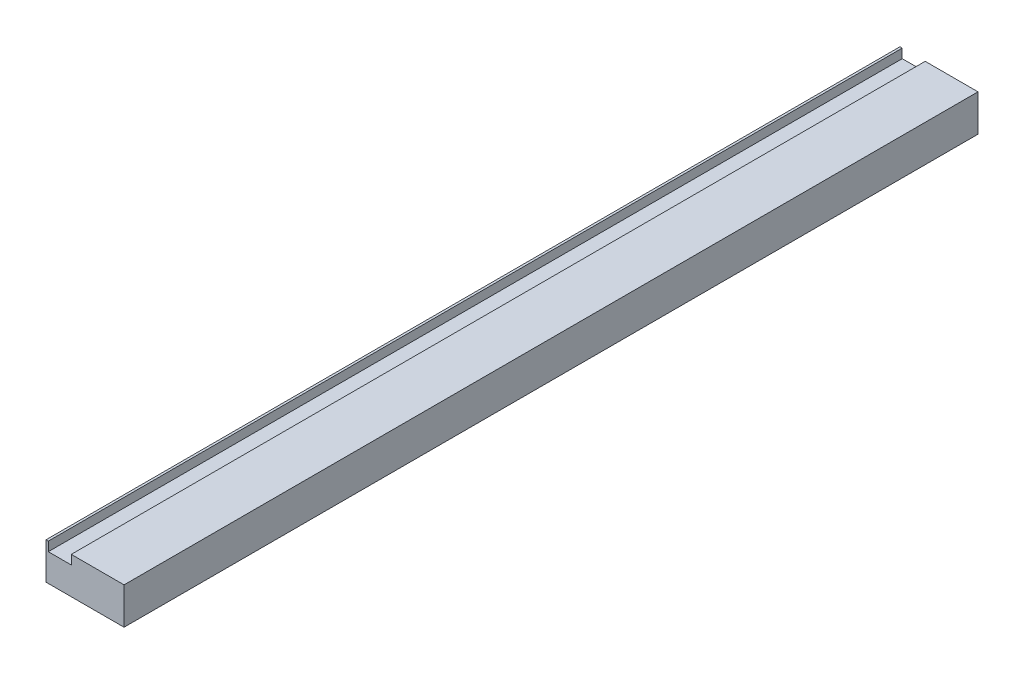
ISO-10303-21;
HEADER;
FILE_DESCRIPTION(('STEP AP214'),'2;1');
FILE_NAME('part.step','',(''),(''),'','','');
FILE_SCHEMA(('AUTOMOTIVE_DESIGN { 1 0 10303 214 1 1 1 1 }'));
ENDSEC;
DATA;
#1=APPLICATION_CONTEXT('core data for automotive mechanical design processes');
#2=APPLICATION_PROTOCOL_DEFINITION('international standard','automotive_design',2000,#1);
#3=PRODUCT_CONTEXT('',#1,'mechanical');
#4=PRODUCT('Part','Part','',(#3));
#5=PRODUCT_RELATED_PRODUCT_CATEGORY('part','',(#4));
#6=PRODUCT_DEFINITION_FORMATION('','',#4);
#7=PRODUCT_DEFINITION_CONTEXT('part definition',#1,'design');
#8=PRODUCT_DEFINITION('design','',#6,#7);
#9=PRODUCT_DEFINITION_SHAPE('','',#8);
#10=(LENGTH_UNIT() NAMED_UNIT(*) SI_UNIT(.MILLI.,.METRE.));
#11=(NAMED_UNIT(*) PLANE_ANGLE_UNIT() SI_UNIT($,.RADIAN.));
#12=(NAMED_UNIT(*) SI_UNIT($,.STERADIAN.) SOLID_ANGLE_UNIT());
#13=UNCERTAINTY_MEASURE_WITH_UNIT(LENGTH_MEASURE(1.E-05),#10,'distance_accuracy_value','');
#14=(GEOMETRIC_REPRESENTATION_CONTEXT(3) GLOBAL_UNCERTAINTY_ASSIGNED_CONTEXT((#13)) GLOBAL_UNIT_ASSIGNED_CONTEXT((#10,
#11,#12)) REPRESENTATION_CONTEXT('',''));
#15=CARTESIAN_POINT('',(0.,0.,0.));
#16=DIRECTION('',(0.,0.,1.));
#17=DIRECTION('',(1.,0.,0.));
#18=AXIS2_PLACEMENT_3D('',#15,#16,#17);
#19=CARTESIAN_POINT('',(0.,20.,0.));
#20=DIRECTION('',(0.,-1.,0.));
#21=DIRECTION('',(0.,0.,-1.));
#22=AXIS2_PLACEMENT_3D('',#19,#20,#21);
#23=PLANE('',#22);
#24=DIRECTION('',(-1.,0.,0.));
#25=VECTOR('',#24,1.);
#26=CARTESIAN_POINT('',(-7.5,20.,-232.5));
#27=LINE('',#26,#25);
#28=CARTESIAN_POINT('',(35.,20.,-232.5));
#29=VERTEX_POINT('',#28);
#30=CARTESIAN_POINT('',(6.25,20.,-232.5));
#31=VERTEX_POINT('',#30);
#32=EDGE_CURVE('E95',#29,#31,#27,.T.);
#33=ORIENTED_EDGE('',*,*,#32,.T.);
#34=DIRECTION('',(0.,0.,-1.));
#35=VECTOR('',#34,1.);
#36=CARTESIAN_POINT('',(6.25,20.,232.5));
#37=LINE('',#36,#35);
#38=CARTESIAN_POINT('',(6.25,20.,232.5));
#39=VERTEX_POINT('',#38);
#40=EDGE_CURVE('E116',#39,#31,#37,.T.);
#41=ORIENTED_EDGE('',*,*,#40,.F.);
#42=DIRECTION('',(1.,0.,0.));
#43=VECTOR('',#42,1.);
#44=CARTESIAN_POINT('',(-7.5,20.,232.5));
#45=LINE('',#44,#43);
#46=CARTESIAN_POINT('',(35.,20.,232.5));
#47=VERTEX_POINT('',#46);
#48=EDGE_CURVE('E101',#39,#47,#45,.T.);
#49=ORIENTED_EDGE('',*,*,#48,.T.);
#50=DIRECTION('',(0.,0.,-1.));
#51=VECTOR('',#50,1.);
#52=CARTESIAN_POINT('',(35.,20.,-232.5));
#53=LINE('',#52,#51);
#54=EDGE_CURVE('E119',#47,#29,#53,.T.);
#55=ORIENTED_EDGE('',*,*,#54,.T.);
#56=EDGE_LOOP('',(#33,#41,#49,#55));
#57=FACE_BOUND('',#56,.T.);
#58=ADVANCED_FACE('F33',(#57),#23,.F.);
#59=CARTESIAN_POINT('',(-7.5,20.,-232.5));
#60=DIRECTION('',(0.,0.,1.));
#61=DIRECTION('',(1.,0.,0.));
#62=AXIS2_PLACEMENT_3D('',#59,#60,#61);
#63=PLANE('',#62);
#64=DIRECTION('',(-1.,0.,0.));
#65=VECTOR('',#64,1.);
#66=CARTESIAN_POINT('',(-6.25,15.,-232.5));
#67=LINE('',#66,#65);
#68=CARTESIAN_POINT('',(6.25,15.,-232.5));
#69=VERTEX_POINT('',#68);
#70=CARTESIAN_POINT('',(-6.25,15.,-232.5));
#71=VERTEX_POINT('',#70);
#72=EDGE_CURVE('E125',#69,#71,#67,.T.);
#73=ORIENTED_EDGE('',*,*,#72,.F.);
#74=DIRECTION('',(0.,1.,0.));
#75=VECTOR('',#74,1.);
#76=CARTESIAN_POINT('',(6.25,15.,-232.5));
#77=LINE('',#76,#75);
#78=EDGE_CURVE('E104',#69,#31,#77,.T.);
#79=ORIENTED_EDGE('',*,*,#78,.T.);
#80=ORIENTED_EDGE('',*,*,#32,.F.);
#81=DIRECTION('',(0.,-1.,0.));
#82=VECTOR('',#81,1.);
#83=CARTESIAN_POINT('',(35.,20.,-232.5));
#84=LINE('',#83,#82);
#85=CARTESIAN_POINT('',(35.,0.,-232.5));
#86=VERTEX_POINT('',#85);
#87=EDGE_CURVE('E135',#29,#86,#84,.T.);
#88=ORIENTED_EDGE('',*,*,#87,.T.);
#89=DIRECTION('',(-1.,0.,0.));
#90=VECTOR('',#89,1.);
#91=CARTESIAN_POINT('',(-7.5,0.,-232.5));
#92=LINE('',#91,#90);
#93=CARTESIAN_POINT('',(-7.5,0.,-232.5));
#94=VERTEX_POINT('',#93);
#95=EDGE_CURVE('E78',#86,#94,#92,.T.);
#96=ORIENTED_EDGE('',*,*,#95,.T.);
#97=DIRECTION('',(0.,-1.,0.));
#98=VECTOR('',#97,1.);
#99=CARTESIAN_POINT('',(-7.5,20.,-232.5));
#100=LINE('',#99,#98);
#101=CARTESIAN_POINT('',(-7.5,20.,-232.5));
#102=VERTEX_POINT('',#101);
#103=EDGE_CURVE('E11',#102,#94,#100,.T.);
#104=ORIENTED_EDGE('',*,*,#103,.F.);
#105=CARTESIAN_POINT('',(-6.25,20.,-232.5));
#106=VERTEX_POINT('',#105);
#107=EDGE_CURVE('E93',#106,#102,#27,.T.);
#108=ORIENTED_EDGE('',*,*,#107,.F.);
#109=DIRECTION('',(0.,1.,0.));
#110=VECTOR('',#109,1.);
#111=CARTESIAN_POINT('',(-6.25,15.,-232.5));
#112=LINE('',#111,#110);
#113=EDGE_CURVE('E48',#71,#106,#112,.T.);
#114=ORIENTED_EDGE('',*,*,#113,.F.);
#115=EDGE_LOOP('',(#73,#79,#80,#88,#96,#104,#108,#114));
#116=FACE_BOUND('',#115,.T.);
#117=ADVANCED_FACE('F35',(#116),#63,.F.);
#118=CARTESIAN_POINT('',(-7.5,20.,232.5));
#119=DIRECTION('',(1.,0.,0.));
#120=DIRECTION('',(0.,0.,-1.));
#121=AXIS2_PLACEMENT_3D('',#118,#119,#120);
#122=PLANE('',#121);
#123=DIRECTION('',(0.,0.,1.));
#124=VECTOR('',#123,1.);
#125=CARTESIAN_POINT('',(-7.5,0.,232.5));
#126=LINE('',#125,#124);
#127=CARTESIAN_POINT('',(-7.5,0.,232.5));
#128=VERTEX_POINT('',#127);
#129=EDGE_CURVE('E69',#94,#128,#126,.T.);
#130=ORIENTED_EDGE('',*,*,#129,.T.);
#131=DIRECTION('',(0.,-1.,0.));
#132=VECTOR('',#131,1.);
#133=CARTESIAN_POINT('',(-7.5,20.,232.5));
#134=LINE('',#133,#132);
#135=CARTESIAN_POINT('',(-7.5,20.,232.5));
#136=VERTEX_POINT('',#135);
#137=EDGE_CURVE('E41',#136,#128,#134,.T.);
#138=ORIENTED_EDGE('',*,*,#137,.F.);
#139=DIRECTION('',(0.,0.,1.));
#140=VECTOR('',#139,1.);
#141=CARTESIAN_POINT('',(-7.5,20.,232.5));
#142=LINE('',#141,#140);
#143=EDGE_CURVE('E57',#102,#136,#142,.T.);
#144=ORIENTED_EDGE('',*,*,#143,.F.);
#145=ORIENTED_EDGE('',*,*,#103,.T.);
#146=EDGE_LOOP('',(#130,#138,#144,#145));
#147=FACE_BOUND('',#146,.T.);
#148=ADVANCED_FACE('F71',(#147),#122,.F.);
#149=CARTESIAN_POINT('',(-7.5,20.,232.5));
#150=DIRECTION('',(0.,0.,-1.));
#151=DIRECTION('',(-1.,0.,0.));
#152=AXIS2_PLACEMENT_3D('',#149,#150,#151);
#153=PLANE('',#152);
#154=ORIENTED_EDGE('',*,*,#48,.F.);
#155=DIRECTION('',(0.,1.,0.));
#156=VECTOR('',#155,1.);
#157=CARTESIAN_POINT('',(6.25,15.,232.5));
#158=LINE('',#157,#156);
#159=CARTESIAN_POINT('',(6.25,15.,232.5));
#160=VERTEX_POINT('',#159);
#161=EDGE_CURVE('E99',#160,#39,#158,.T.);
#162=ORIENTED_EDGE('',*,*,#161,.F.);
#163=DIRECTION('',(1.,0.,0.));
#164=VECTOR('',#163,1.);
#165=CARTESIAN_POINT('',(-6.25,15.,232.5));
#166=LINE('',#165,#164);
#167=CARTESIAN_POINT('',(-6.25,15.,232.5));
#168=VERTEX_POINT('',#167);
#169=EDGE_CURVE('E107',#168,#160,#166,.T.);
#170=ORIENTED_EDGE('',*,*,#169,.F.);
#171=DIRECTION('',(0.,1.,0.));
#172=VECTOR('',#171,1.);
#173=CARTESIAN_POINT('',(-6.25,15.,232.5));
#174=LINE('',#173,#172);
#175=CARTESIAN_POINT('',(-6.25,20.,232.5));
#176=VERTEX_POINT('',#175);
#177=EDGE_CURVE('E109',#168,#176,#174,.T.);
#178=ORIENTED_EDGE('',*,*,#177,.T.);
#179=EDGE_CURVE('E88',#136,#176,#45,.T.);
#180=ORIENTED_EDGE('',*,*,#179,.F.);
#181=ORIENTED_EDGE('',*,*,#137,.T.);
#182=DIRECTION('',(1.,0.,0.));
#183=VECTOR('',#182,1.);
#184=CARTESIAN_POINT('',(-7.5,0.,232.5));
#185=LINE('',#184,#183);
#186=CARTESIAN_POINT('',(35.,0.,232.5));
#187=VERTEX_POINT('',#186);
#188=EDGE_CURVE('E77',#128,#187,#185,.T.);
#189=ORIENTED_EDGE('',*,*,#188,.T.);
#190=DIRECTION('',(0.,1.,0.));
#191=VECTOR('',#190,1.);
#192=CARTESIAN_POINT('',(35.,20.,232.5));
#193=LINE('',#192,#191);
#194=EDGE_CURVE('E132',#187,#47,#193,.T.);
#195=ORIENTED_EDGE('',*,*,#194,.T.);
#196=EDGE_LOOP('',(#154,#162,#170,#178,#180,#181,#189,#195));
#197=FACE_BOUND('',#196,.T.);
#198=ADVANCED_FACE('F83',(#197),#153,.F.);
#199=ORIENTED_EDGE('',*,*,#179,.T.);
#200=DIRECTION('',(0.,0.,1.));
#201=VECTOR('',#200,1.);
#202=CARTESIAN_POINT('',(-6.25,20.,232.5));
#203=LINE('',#202,#201);
#204=EDGE_CURVE('E113',#106,#176,#203,.T.);
#205=ORIENTED_EDGE('',*,*,#204,.F.);
#206=ORIENTED_EDGE('',*,*,#107,.T.);
#207=ORIENTED_EDGE('',*,*,#143,.T.);
#208=EDGE_LOOP('',(#199,#205,#206,#207));
#209=FACE_BOUND('',#208,.T.);
#210=ADVANCED_FACE('F177',(#209),#23,.F.);
#211=CARTESIAN_POINT('',(0.,0.,0.));
#212=DIRECTION('',(0.,-1.,0.));
#213=DIRECTION('',(0.,0.,-1.));
#214=AXIS2_PLACEMENT_3D('',#211,#212,#213);
#215=PLANE('',#214);
#216=ORIENTED_EDGE('',*,*,#95,.F.);
#217=DIRECTION('',(0.,0.,1.));
#218=VECTOR('',#217,1.);
#219=CARTESIAN_POINT('',(35.,0.,-232.5));
#220=LINE('',#219,#218);
#221=EDGE_CURVE('E92',#86,#187,#220,.T.);
#222=ORIENTED_EDGE('',*,*,#221,.T.);
#223=ORIENTED_EDGE('',*,*,#188,.F.);
#224=ORIENTED_EDGE('',*,*,#129,.F.);
#225=EDGE_LOOP('',(#216,#222,#223,#224));
#226=FACE_BOUND('',#225,.T.);
#227=ADVANCED_FACE('F90',(#226),#215,.T.);
#228=CARTESIAN_POINT('',(6.25,15.,232.5));
#229=DIRECTION('',(1.,0.,0.));
#230=DIRECTION('',(0.,0.,-1.));
#231=AXIS2_PLACEMENT_3D('',#228,#229,#230);
#232=PLANE('',#231);
#233=ORIENTED_EDGE('',*,*,#40,.T.);
#234=ORIENTED_EDGE('',*,*,#78,.F.);
#235=DIRECTION('',(0.,0.,-1.));
#236=VECTOR('',#235,1.);
#237=CARTESIAN_POINT('',(6.25,15.,232.5));
#238=LINE('',#237,#236);
#239=EDGE_CURVE('E115',#160,#69,#238,.T.);
#240=ORIENTED_EDGE('',*,*,#239,.F.);
#241=ORIENTED_EDGE('',*,*,#161,.T.);
#242=EDGE_LOOP('',(#233,#234,#240,#241));
#243=FACE_BOUND('',#242,.T.);
#244=ADVANCED_FACE('F171',(#243),#232,.F.);
#245=CARTESIAN_POINT('',(-6.25,15.,232.5));
#246=DIRECTION('',(-1.,0.,0.));
#247=DIRECTION('',(0.,0.,1.));
#248=AXIS2_PLACEMENT_3D('',#245,#246,#247);
#249=PLANE('',#248);
#250=ORIENTED_EDGE('',*,*,#204,.T.);
#251=ORIENTED_EDGE('',*,*,#177,.F.);
#252=DIRECTION('',(0.,0.,1.));
#253=VECTOR('',#252,1.);
#254=CARTESIAN_POINT('',(-6.25,15.,232.5));
#255=LINE('',#254,#253);
#256=EDGE_CURVE('E122',#71,#168,#255,.T.);
#257=ORIENTED_EDGE('',*,*,#256,.F.);
#258=ORIENTED_EDGE('',*,*,#113,.T.);
#259=EDGE_LOOP('',(#250,#251,#257,#258));
#260=FACE_BOUND('',#259,.T.);
#261=ADVANCED_FACE('F175',(#260),#249,.F.);
#262=CARTESIAN_POINT('',(0.,15.,0.));
#263=DIRECTION('',(0.,-1.,0.));
#264=DIRECTION('',(0.,0.,-1.));
#265=AXIS2_PLACEMENT_3D('',#262,#263,#264);
#266=PLANE('',#265);
#267=ORIENTED_EDGE('',*,*,#239,.T.);
#268=ORIENTED_EDGE('',*,*,#72,.T.);
#269=ORIENTED_EDGE('',*,*,#256,.T.);
#270=ORIENTED_EDGE('',*,*,#169,.T.);
#271=EDGE_LOOP('',(#267,#268,#269,#270));
#272=FACE_BOUND('',#271,.T.);
#273=ADVANCED_FACE('F174',(#272),#266,.F.);
#274=CARTESIAN_POINT('',(35.,0.,0.));
#275=DIRECTION('',(-1.,0.,0.));
#276=DIRECTION('',(0.,0.,1.));
#277=AXIS2_PLACEMENT_3D('',#274,#275,#276);
#278=PLANE('',#277);
#279=ORIENTED_EDGE('',*,*,#87,.F.);
#280=ORIENTED_EDGE('',*,*,#54,.F.);
#281=ORIENTED_EDGE('',*,*,#194,.F.);
#282=ORIENTED_EDGE('',*,*,#221,.F.);
#283=EDGE_LOOP('',(#279,#280,#281,#282));
#284=FACE_BOUND('',#283,.T.);
#285=ADVANCED_FACE('F146',(#284),#278,.F.);
#286=CLOSED_SHELL('',(#58,#117,#148,#198,#210,#227,#244,#261,#273,#285));
#287=MANIFOLD_SOLID_BREP('B2',#286);
#288=ADVANCED_BREP_SHAPE_REPRESENTATION('',(#18,#287),#14);
#289=SHAPE_DEFINITION_REPRESENTATION(#9,#288);
ENDSEC;
END-ISO-10303-21;
